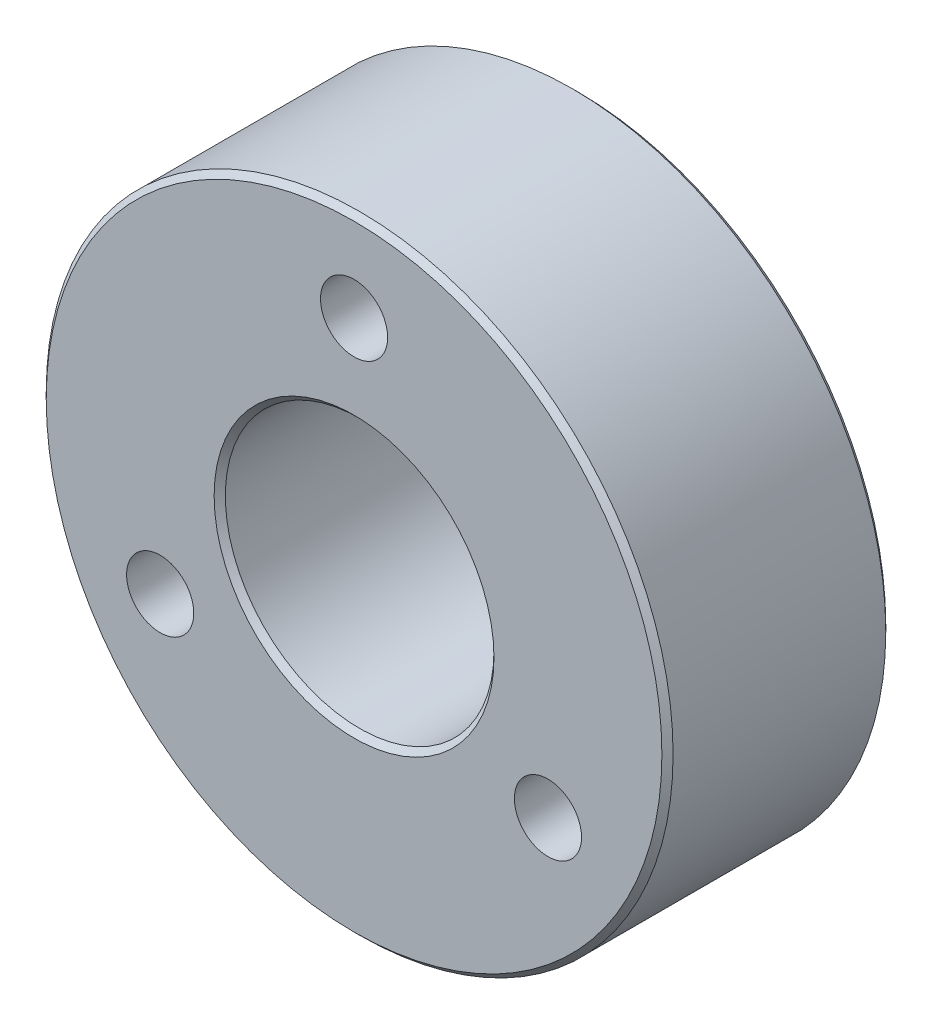
ISO-10303-21;
HEADER;
FILE_DESCRIPTION(('STEP AP214'),'2;1');
FILE_NAME('part.step','',(''),(''),'','','');
FILE_SCHEMA(('AUTOMOTIVE_DESIGN { 1 0 10303 214 1 1 1 1 }'));
ENDSEC;
DATA;
#1=APPLICATION_CONTEXT('core data for automotive mechanical design processes');
#2=APPLICATION_PROTOCOL_DEFINITION('international standard','automotive_design',2000,#1);
#3=PRODUCT_CONTEXT('',#1,'mechanical');
#4=PRODUCT('Part','Part','',(#3));
#5=PRODUCT_RELATED_PRODUCT_CATEGORY('part','',(#4));
#6=PRODUCT_DEFINITION_FORMATION('','',#4);
#7=PRODUCT_DEFINITION_CONTEXT('part definition',#1,'design');
#8=PRODUCT_DEFINITION('design','',#6,#7);
#9=PRODUCT_DEFINITION_SHAPE('','',#8);
#10=(LENGTH_UNIT() NAMED_UNIT(*) SI_UNIT(.MILLI.,.METRE.));
#11=(NAMED_UNIT(*) PLANE_ANGLE_UNIT() SI_UNIT($,.RADIAN.));
#12=(NAMED_UNIT(*) SI_UNIT($,.STERADIAN.) SOLID_ANGLE_UNIT());
#13=UNCERTAINTY_MEASURE_WITH_UNIT(LENGTH_MEASURE(1.E-05),#10,'distance_accuracy_value','');
#14=(GEOMETRIC_REPRESENTATION_CONTEXT(3) GLOBAL_UNCERTAINTY_ASSIGNED_CONTEXT((#13)) GLOBAL_UNIT_ASSIGNED_CONTEXT((#10,
#11,#12)) REPRESENTATION_CONTEXT('',''));
#15=CARTESIAN_POINT('',(0.,0.,0.));
#16=DIRECTION('',(0.,0.,1.));
#17=DIRECTION('',(1.,0.,0.));
#18=AXIS2_PLACEMENT_3D('',#15,#16,#17);
#19=CARTESIAN_POINT('',(0.,0.,5.));
#20=DIRECTION('',(0.,0.,1.));
#21=DIRECTION('',(1.,0.,0.));
#22=AXIS2_PLACEMENT_3D('',#19,#20,#21);
#23=PLANE('',#22);
#24=CARTESIAN_POINT('',(0.,0.,5.));
#25=DIRECTION('',(0.,0.,1.));
#26=DIRECTION('',(1.,0.,0.));
#27=AXIS2_PLACEMENT_3D('',#24,#25,#26);
#28=CIRCLE('',#27,6.25000000000001);
#29=CARTESIAN_POINT('',(6.25000000000001,0.,5.));
#30=VERTEX_POINT('',#29);
#31=EDGE_CURVE('E46',#30,#30,#28,.F.);
#32=ORIENTED_EDGE('',*,*,#31,.T.);
#33=EDGE_LOOP('',(#32));
#34=FACE_BOUND('',#33,.T.);
#35=CARTESIAN_POINT('',(0.,0.,5.));
#36=DIRECTION('',(0.,0.,1.));
#37=DIRECTION('',(1.,0.,0.));
#38=AXIS2_PLACEMENT_3D('',#35,#36,#37);
#39=CIRCLE('',#38,13.75);
#40=CARTESIAN_POINT('',(13.75,0.,5.));
#41=VERTEX_POINT('',#40);
#42=EDGE_CURVE('E50',#41,#41,#39,.T.);
#43=ORIENTED_EDGE('',*,*,#42,.T.);
#44=EDGE_LOOP('',(#43));
#45=FACE_BOUND('',#44,.T.);
#46=CARTESIAN_POINT('',(8.66025403784439,-5.,5.));
#47=DIRECTION('',(0.,0.,1.));
#48=DIRECTION('',(1.,0.,0.));
#49=AXIS2_PLACEMENT_3D('',#46,#47,#48);
#50=CIRCLE('',#49,1.50000000000005);
#51=CARTESIAN_POINT('',(10.1602540378444,-5.,5.));
#52=VERTEX_POINT('',#51);
#53=EDGE_CURVE('E71',#52,#52,#50,.T.);
#54=ORIENTED_EDGE('',*,*,#53,.F.);
#55=EDGE_LOOP('',(#54));
#56=FACE_BOUND('',#55,.T.);
#57=CARTESIAN_POINT('',(0.,10.,5.));
#58=DIRECTION('',(0.,0.,1.));
#59=DIRECTION('',(1.,0.,0.));
#60=AXIS2_PLACEMENT_3D('',#57,#58,#59);
#61=CIRCLE('',#60,1.5);
#62=CARTESIAN_POINT('',(1.5,10.,5.));
#63=VERTEX_POINT('',#62);
#64=EDGE_CURVE('E67',#63,#63,#61,.T.);
#65=ORIENTED_EDGE('',*,*,#64,.F.);
#66=EDGE_LOOP('',(#65));
#67=FACE_BOUND('',#66,.T.);
#68=CARTESIAN_POINT('',(-8.66025403784438,-5.,5.));
#69=DIRECTION('',(0.,0.,1.));
#70=DIRECTION('',(1.,0.,0.));
#71=AXIS2_PLACEMENT_3D('',#68,#69,#70);
#72=CIRCLE('',#71,1.50000000000009);
#73=CARTESIAN_POINT('',(-7.16025403784429,-5.,5.));
#74=VERTEX_POINT('',#73);
#75=EDGE_CURVE('E77',#74,#74,#72,.T.);
#76=ORIENTED_EDGE('',*,*,#75,.F.);
#77=EDGE_LOOP('',(#76));
#78=FACE_BOUND('',#77,.T.);
#79=ADVANCED_FACE('F34',(#34,#45,#56,#67,#78),#23,.T.);
#80=CARTESIAN_POINT('',(0.,0.,-5.));
#81=DIRECTION('',(0.,0.,1.));
#82=DIRECTION('',(1.,0.,0.));
#83=AXIS2_PLACEMENT_3D('',#80,#81,#82);
#84=PLANE('',#83);
#85=CARTESIAN_POINT('',(0.,0.,-5.));
#86=DIRECTION('',(0.,0.,1.));
#87=DIRECTION('',(1.,0.,0.));
#88=AXIS2_PLACEMENT_3D('',#85,#86,#87);
#89=CIRCLE('',#88,6.25000000000001);
#90=CARTESIAN_POINT('',(6.25000000000001,0.,-5.));
#91=VERTEX_POINT('',#90);
#92=EDGE_CURVE('E61',#91,#91,#89,.T.);
#93=ORIENTED_EDGE('',*,*,#92,.T.);
#94=EDGE_LOOP('',(#93));
#95=FACE_BOUND('',#94,.T.);
#96=CARTESIAN_POINT('',(0.,0.,-5.));
#97=DIRECTION('',(0.,0.,1.));
#98=DIRECTION('',(1.,0.,0.));
#99=AXIS2_PLACEMENT_3D('',#96,#97,#98);
#100=CIRCLE('',#99,13.75);
#101=CARTESIAN_POINT('',(13.75,0.,-5.));
#102=VERTEX_POINT('',#101);
#103=EDGE_CURVE('E64',#102,#102,#100,.F.);
#104=ORIENTED_EDGE('',*,*,#103,.T.);
#105=EDGE_LOOP('',(#104));
#106=FACE_BOUND('',#105,.T.);
#107=CARTESIAN_POINT('',(0.,10.,-5.));
#108=DIRECTION('',(0.,0.,1.));
#109=DIRECTION('',(1.,0.,0.));
#110=AXIS2_PLACEMENT_3D('',#107,#108,#109);
#111=CIRCLE('',#110,1.5);
#112=CARTESIAN_POINT('',(1.5,10.,-5.));
#113=VERTEX_POINT('',#112);
#114=EDGE_CURVE('E68',#113,#113,#111,.T.);
#115=ORIENTED_EDGE('',*,*,#114,.T.);
#116=EDGE_LOOP('',(#115));
#117=FACE_BOUND('',#116,.T.);
#118=CARTESIAN_POINT('',(8.66025403784439,-5.,-5.));
#119=DIRECTION('',(0.,0.,1.));
#120=DIRECTION('',(1.,0.,0.));
#121=AXIS2_PLACEMENT_3D('',#118,#119,#120);
#122=CIRCLE('',#121,1.50000000000005);
#123=CARTESIAN_POINT('',(10.1602540378444,-5.,-5.));
#124=VERTEX_POINT('',#123);
#125=EDGE_CURVE('E74',#124,#124,#122,.T.);
#126=ORIENTED_EDGE('',*,*,#125,.T.);
#127=EDGE_LOOP('',(#126));
#128=FACE_BOUND('',#127,.T.);
#129=CARTESIAN_POINT('',(-8.66025403784438,-5.,-5.));
#130=DIRECTION('',(0.,0.,1.));
#131=DIRECTION('',(1.,0.,0.));
#132=AXIS2_PLACEMENT_3D('',#129,#130,#131);
#133=CIRCLE('',#132,1.50000000000009);
#134=CARTESIAN_POINT('',(-7.16025403784429,-5.,-5.));
#135=VERTEX_POINT('',#134);
#136=EDGE_CURVE('E80',#135,#135,#133,.T.);
#137=ORIENTED_EDGE('',*,*,#136,.T.);
#138=EDGE_LOOP('',(#137));
#139=FACE_BOUND('',#138,.T.);
#140=ADVANCED_FACE('F90',(#95,#106,#117,#128,#139),#84,.F.);
#141=CARTESIAN_POINT('',(0.,0.,5.));
#142=DIRECTION('',(0.,0.,-1.));
#143=DIRECTION('',(-1.,0.,0.));
#144=AXIS2_PLACEMENT_3D('',#141,#142,#143);
#145=CYLINDRICAL_SURFACE('',#144,14.);
#146=CARTESIAN_POINT('',(0.,0.,-4.74999999999999));
#147=DIRECTION('',(0.,0.,1.));
#148=DIRECTION('',(1.,0.,0.));
#149=AXIS2_PLACEMENT_3D('',#146,#147,#148);
#150=CIRCLE('',#149,14.);
#151=CARTESIAN_POINT('',(14.,0.,-4.74999999999999));
#152=VERTEX_POINT('',#151);
#153=EDGE_CURVE('E10',#152,#152,#150,.T.);
#154=ORIENTED_EDGE('',*,*,#153,.T.);
#155=EDGE_LOOP('',(#154));
#156=FACE_BOUND('',#155,.T.);
#157=CARTESIAN_POINT('',(0.,0.,4.75));
#158=DIRECTION('',(0.,0.,1.));
#159=DIRECTION('',(1.,0.,0.));
#160=AXIS2_PLACEMENT_3D('',#157,#158,#159);
#161=CIRCLE('',#160,14.);
#162=CARTESIAN_POINT('',(14.,0.,4.75));
#163=VERTEX_POINT('',#162);
#164=EDGE_CURVE('E42',#163,#163,#161,.F.);
#165=ORIENTED_EDGE('',*,*,#164,.T.);
#166=EDGE_LOOP('',(#165));
#167=FACE_BOUND('',#166,.T.);
#168=ADVANCED_FACE('F96',(#156,#167),#145,.T.);
#169=CARTESIAN_POINT('',(0.,0.,5.));
#170=DIRECTION('',(0.,0.,-1.));
#171=DIRECTION('',(-1.,0.,0.));
#172=AXIS2_PLACEMENT_3D('',#169,#170,#171);
#173=CYLINDRICAL_SURFACE('',#172,6.);
#174=CARTESIAN_POINT('',(0.,0.,-4.74999999999999));
#175=DIRECTION('',(0.,0.,1.));
#176=DIRECTION('',(1.,0.,0.));
#177=AXIS2_PLACEMENT_3D('',#174,#175,#176);
#178=CIRCLE('',#177,6.);
#179=CARTESIAN_POINT('',(6.,0.,-4.74999999999999));
#180=VERTEX_POINT('',#179);
#181=EDGE_CURVE('E55',#180,#180,#178,.F.);
#182=ORIENTED_EDGE('',*,*,#181,.T.);
#183=EDGE_LOOP('',(#182));
#184=FACE_BOUND('',#183,.T.);
#185=CARTESIAN_POINT('',(0.,0.,4.74999999999999));
#186=DIRECTION('',(0.,0.,1.));
#187=DIRECTION('',(1.,0.,0.));
#188=AXIS2_PLACEMENT_3D('',#185,#186,#187);
#189=CIRCLE('',#188,6.);
#190=CARTESIAN_POINT('',(6.,0.,4.74999999999999));
#191=VERTEX_POINT('',#190);
#192=EDGE_CURVE('E58',#191,#191,#189,.T.);
#193=ORIENTED_EDGE('',*,*,#192,.T.);
#194=EDGE_LOOP('',(#193));
#195=FACE_BOUND('',#194,.T.);
#196=ADVANCED_FACE('F101',(#184,#195),#173,.F.);
#197=CARTESIAN_POINT('',(0.,10.,5.));
#198=DIRECTION('',(0.,0.,-1.));
#199=DIRECTION('',(-1.,0.,0.));
#200=AXIS2_PLACEMENT_3D('',#197,#198,#199);
#201=CYLINDRICAL_SURFACE('',#200,1.5);
#202=ORIENTED_EDGE('',*,*,#64,.T.);
#203=EDGE_LOOP('',(#202));
#204=FACE_BOUND('',#203,.T.);
#205=ORIENTED_EDGE('',*,*,#114,.F.);
#206=EDGE_LOOP('',(#205));
#207=FACE_BOUND('',#206,.T.);
#208=ADVANCED_FACE('F144',(#204,#207),#201,.F.);
#209=CARTESIAN_POINT('',(8.66025403784439,-5.,5.));
#210=DIRECTION('',(0.,0.,-1.));
#211=DIRECTION('',(-1.,0.,0.));
#212=AXIS2_PLACEMENT_3D('',#209,#210,#211);
#213=CYLINDRICAL_SURFACE('',#212,1.50000000000005);
#214=ORIENTED_EDGE('',*,*,#53,.T.);
#215=EDGE_LOOP('',(#214));
#216=FACE_BOUND('',#215,.T.);
#217=ORIENTED_EDGE('',*,*,#125,.F.);
#218=EDGE_LOOP('',(#217));
#219=FACE_BOUND('',#218,.T.);
#220=ADVANCED_FACE('F139',(#216,#219),#213,.F.);
#221=CARTESIAN_POINT('',(-8.66025403784438,-5.,5.));
#222=DIRECTION('',(0.,0.,-1.));
#223=DIRECTION('',(-1.,0.,0.));
#224=AXIS2_PLACEMENT_3D('',#221,#222,#223);
#225=CYLINDRICAL_SURFACE('',#224,1.50000000000009);
#226=ORIENTED_EDGE('',*,*,#75,.T.);
#227=EDGE_LOOP('',(#226));
#228=FACE_BOUND('',#227,.T.);
#229=ORIENTED_EDGE('',*,*,#136,.F.);
#230=EDGE_LOOP('',(#229));
#231=FACE_BOUND('',#230,.T.);
#232=ADVANCED_FACE('F86',(#228,#231),#225,.F.);
#233=CARTESIAN_POINT('',(0.,0.,-5.));
#234=DIRECTION('',(0.,0.,-1.));
#235=DIRECTION('',(-1.,0.,0.));
#236=AXIS2_PLACEMENT_3D('',#233,#234,#235);
#237=CONICAL_SURFACE('',#236,6.25000000000001,0.785398163397443);
#238=ORIENTED_EDGE('',*,*,#181,.F.);
#239=EDGE_LOOP('',(#238));
#240=FACE_BOUND('',#239,.T.);
#241=ORIENTED_EDGE('',*,*,#92,.F.);
#242=EDGE_LOOP('',(#241));
#243=FACE_BOUND('',#242,.T.);
#244=ADVANCED_FACE('F107',(#240,#243),#237,.F.);
#245=CARTESIAN_POINT('',(0.,0.,4.74999999999999));
#246=DIRECTION('',(0.,0.,1.));
#247=DIRECTION('',(1.,0.,0.));
#248=AXIS2_PLACEMENT_3D('',#245,#246,#247);
#249=CONICAL_SURFACE('',#248,6.,0.785398163397462);
#250=ORIENTED_EDGE('',*,*,#31,.F.);
#251=EDGE_LOOP('',(#250));
#252=FACE_BOUND('',#251,.T.);
#253=ORIENTED_EDGE('',*,*,#192,.F.);
#254=EDGE_LOOP('',(#253));
#255=FACE_BOUND('',#254,.T.);
#256=ADVANCED_FACE('F113',(#252,#255),#249,.F.);
#257=CARTESIAN_POINT('',(0.,0.,-4.74999999999999));
#258=DIRECTION('',(0.,0.,1.));
#259=DIRECTION('',(1.,0.,0.));
#260=AXIS2_PLACEMENT_3D('',#257,#258,#259);
#261=CONICAL_SURFACE('',#260,14.,0.785398163397448);
#262=ORIENTED_EDGE('',*,*,#103,.F.);
#263=EDGE_LOOP('',(#262));
#264=FACE_BOUND('',#263,.T.);
#265=ORIENTED_EDGE('',*,*,#153,.F.);
#266=EDGE_LOOP('',(#265));
#267=FACE_BOUND('',#266,.T.);
#268=ADVANCED_FACE('F119',(#264,#267),#261,.T.);
#269=CARTESIAN_POINT('',(0.,0.,5.));
#270=DIRECTION('',(0.,0.,-1.));
#271=DIRECTION('',(-1.,0.,0.));
#272=AXIS2_PLACEMENT_3D('',#269,#270,#271);
#273=CONICAL_SURFACE('',#272,13.75,0.785398163397438);
#274=ORIENTED_EDGE('',*,*,#164,.F.);
#275=EDGE_LOOP('',(#274));
#276=FACE_BOUND('',#275,.T.);
#277=ORIENTED_EDGE('',*,*,#42,.F.);
#278=EDGE_LOOP('',(#277));
#279=FACE_BOUND('',#278,.T.);
#280=ADVANCED_FACE('F37',(#276,#279),#273,.T.);
#281=CLOSED_SHELL('',(#79,#140,#168,#196,#208,#220,#232,#244,#256,#268,#280));
#282=MANIFOLD_SOLID_BREP('B2',#281);
#283=ADVANCED_BREP_SHAPE_REPRESENTATION('',(#18,#282),#14);
#284=SHAPE_DEFINITION_REPRESENTATION(#9,#283);
ENDSEC;
END-ISO-10303-21;
